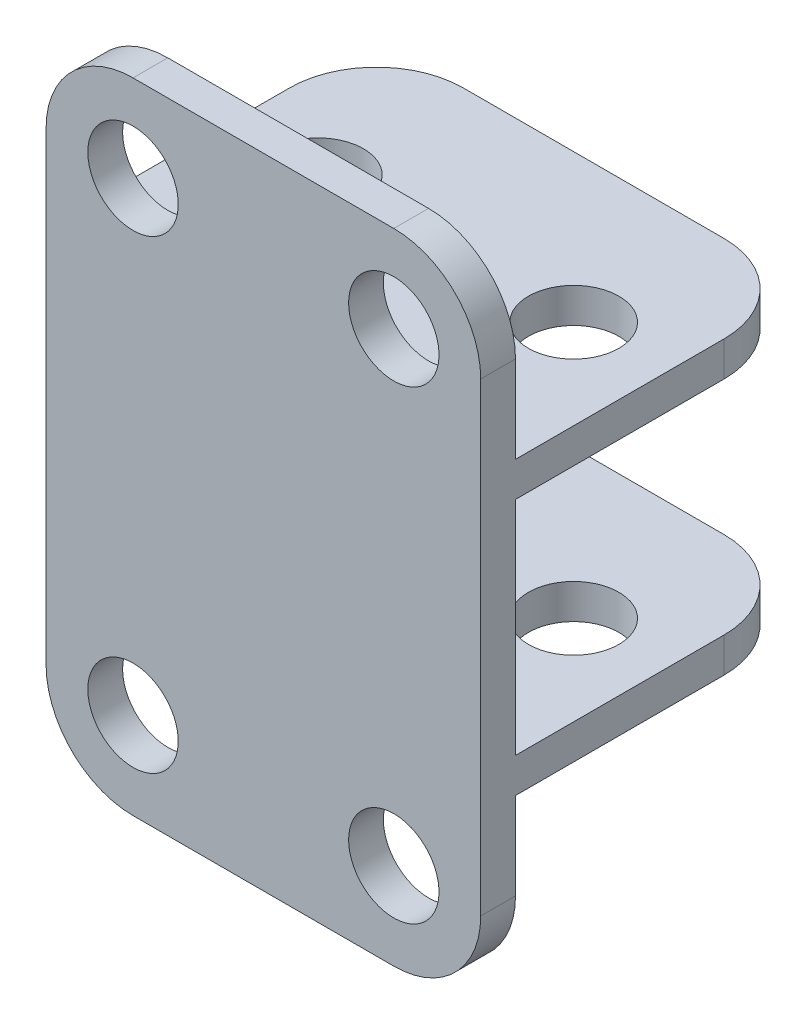
ISO-10303-21;
HEADER;
FILE_DESCRIPTION(('STEP AP214'),'2;1');
FILE_NAME('part.step','',(''),(''),'','','');
FILE_SCHEMA(('AUTOMOTIVE_DESIGN { 1 0 10303 214 1 1 1 1 }'));
ENDSEC;
DATA;
#1=APPLICATION_CONTEXT('core data for automotive mechanical design processes');
#2=APPLICATION_PROTOCOL_DEFINITION('international standard','automotive_design',2000,#1);
#3=PRODUCT_CONTEXT('',#1,'mechanical');
#4=PRODUCT('Part','Part','',(#3));
#5=PRODUCT_RELATED_PRODUCT_CATEGORY('part','',(#4));
#6=PRODUCT_DEFINITION_FORMATION('','',#4);
#7=PRODUCT_DEFINITION_CONTEXT('part definition',#1,'design');
#8=PRODUCT_DEFINITION('design','',#6,#7);
#9=PRODUCT_DEFINITION_SHAPE('','',#8);
#10=(LENGTH_UNIT() NAMED_UNIT(*) SI_UNIT(.MILLI.,.METRE.));
#11=(NAMED_UNIT(*) PLANE_ANGLE_UNIT() SI_UNIT($,.RADIAN.));
#12=(NAMED_UNIT(*) SI_UNIT($,.STERADIAN.) SOLID_ANGLE_UNIT());
#13=UNCERTAINTY_MEASURE_WITH_UNIT(LENGTH_MEASURE(1.E-05),#10,'distance_accuracy_value','');
#14=(GEOMETRIC_REPRESENTATION_CONTEXT(3) GLOBAL_UNCERTAINTY_ASSIGNED_CONTEXT((#13)) GLOBAL_UNIT_ASSIGNED_CONTEXT((#10,
#11,#12)) REPRESENTATION_CONTEXT('',''));
#15=CARTESIAN_POINT('',(0.,0.,0.));
#16=DIRECTION('',(0.,0.,1.));
#17=DIRECTION('',(1.,0.,0.));
#18=AXIS2_PLACEMENT_3D('',#15,#16,#17);
#19=CARTESIAN_POINT('',(0.,0.,0.));
#20=DIRECTION('',(0.,1.,0.));
#21=DIRECTION('',(0.,0.,1.));
#22=AXIS2_PLACEMENT_3D('',#19,#20,#21);
#23=PLANE('',#22);
#24=CARTESIAN_POINT('',(7.345,0.,0.));
#25=DIRECTION('',(0.,1.,0.));
#26=DIRECTION('',(0.,0.,1.));
#27=AXIS2_PLACEMENT_3D('',#24,#25,#26);
#28=CIRCLE('',#27,2.6);
#29=CARTESIAN_POINT('',(7.345,0.,2.6));
#30=VERTEX_POINT('',#29);
#31=EDGE_CURVE('E265',#30,#30,#28,.T.);
#32=ORIENTED_EDGE('',*,*,#31,.T.);
#33=EDGE_LOOP('',(#32));
#34=FACE_BOUND('',#33,.T.);
#35=CARTESIAN_POINT('',(-7.345,0.,0.));
#36=DIRECTION('',(0.,1.,0.));
#37=DIRECTION('',(0.,0.,1.));
#38=AXIS2_PLACEMENT_3D('',#35,#36,#37);
#39=CIRCLE('',#38,2.6);
#40=CARTESIAN_POINT('',(-7.345,0.,2.6));
#41=VERTEX_POINT('',#40);
#42=EDGE_CURVE('E273',#41,#41,#39,.T.);
#43=ORIENTED_EDGE('',*,*,#42,.T.);
#44=EDGE_LOOP('',(#43));
#45=FACE_BOUND('',#44,.T.);
#46=DIRECTION('',(0.,0.,1.));
#47=VECTOR('',#46,1.);
#48=CARTESIAN_POINT('',(-12.5,0.,8.5));
#49=LINE('',#48,#47);
#50=CARTESIAN_POINT('',(-12.5,0.,-3.5));
#51=VERTEX_POINT('',#50);
#52=CARTESIAN_POINT('',(-12.5,0.,8.5));
#53=VERTEX_POINT('',#52);
#54=EDGE_CURVE('E198',#51,#53,#49,.T.);
#55=ORIENTED_EDGE('',*,*,#54,.F.);
#56=CARTESIAN_POINT('',(-7.5,0.,-3.5));
#57=DIRECTION('',(0.,1.,0.));
#58=DIRECTION('',(0.,0.,1.));
#59=AXIS2_PLACEMENT_3D('',#56,#57,#58);
#60=CIRCLE('',#59,5.);
#61=CARTESIAN_POINT('',(-7.5,0.,-8.5));
#62=VERTEX_POINT('',#61);
#63=EDGE_CURVE('E327',#51,#62,#60,.F.);
#64=ORIENTED_EDGE('',*,*,#63,.T.);
#65=DIRECTION('',(-1.,0.,0.));
#66=VECTOR('',#65,1.);
#67=CARTESIAN_POINT('',(12.5,0.,-8.5));
#68=LINE('',#67,#66);
#69=CARTESIAN_POINT('',(7.5,0.,-8.5));
#70=VERTEX_POINT('',#69);
#71=EDGE_CURVE('E197',#70,#62,#68,.T.);
#72=ORIENTED_EDGE('',*,*,#71,.F.);
#73=CARTESIAN_POINT('',(7.5,0.,-3.5));
#74=DIRECTION('',(0.,1.,0.));
#75=DIRECTION('',(0.,0.,1.));
#76=AXIS2_PLACEMENT_3D('',#73,#74,#75);
#77=CIRCLE('',#76,5.);
#78=CARTESIAN_POINT('',(12.5,0.,-3.5));
#79=VERTEX_POINT('',#78);
#80=EDGE_CURVE('E196',#70,#79,#77,.F.);
#81=ORIENTED_EDGE('',*,*,#80,.T.);
#82=DIRECTION('',(0.,0.,-1.));
#83=VECTOR('',#82,1.);
#84=CARTESIAN_POINT('',(12.5,0.,8.5));
#85=LINE('',#84,#83);
#86=CARTESIAN_POINT('',(12.5,0.,8.5));
#87=VERTEX_POINT('',#86);
#88=EDGE_CURVE('E181',#87,#79,#85,.T.);
#89=ORIENTED_EDGE('',*,*,#88,.F.);
#90=DIRECTION('',(-1.,0.,0.));
#91=VECTOR('',#90,1.);
#92=CARTESIAN_POINT('',(-12.5,0.,8.5));
#93=LINE('',#92,#91);
#94=EDGE_CURVE('E194',#87,#53,#93,.T.);
#95=ORIENTED_EDGE('',*,*,#94,.T.);
#96=EDGE_LOOP('',(#55,#64,#72,#81,#89,#95));
#97=FACE_BOUND('',#96,.T.);
#98=ADVANCED_FACE('F39',(#34,#45,#97),#23,.F.);
#99=CARTESIAN_POINT('',(0.,16.75,0.));
#100=DIRECTION('',(0.,-1.,0.));
#101=DIRECTION('',(0.,0.,1.));
#102=AXIS2_PLACEMENT_3D('',#99,#100,#101);
#103=PLANE('',#102);
#104=CARTESIAN_POINT('',(7.345,16.75,0.));
#105=DIRECTION('',(0.,1.,0.));
#106=DIRECTION('',(0.,0.,1.));
#107=AXIS2_PLACEMENT_3D('',#104,#105,#106);
#108=CIRCLE('',#107,2.6);
#109=CARTESIAN_POINT('',(7.345,16.75,2.6));
#110=VERTEX_POINT('',#109);
#111=EDGE_CURVE('E226',#110,#110,#108,.T.);
#112=ORIENTED_EDGE('',*,*,#111,.F.);
#113=EDGE_LOOP('',(#112));
#114=FACE_BOUND('',#113,.T.);
#115=CARTESIAN_POINT('',(-7.345,16.75,0.));
#116=DIRECTION('',(0.,1.,0.));
#117=DIRECTION('',(0.,0.,1.));
#118=AXIS2_PLACEMENT_3D('',#115,#116,#117);
#119=CIRCLE('',#118,2.6);
#120=CARTESIAN_POINT('',(-7.345,16.75,2.6));
#121=VERTEX_POINT('',#120);
#122=EDGE_CURVE('E230',#121,#121,#119,.T.);
#123=ORIENTED_EDGE('',*,*,#122,.F.);
#124=EDGE_LOOP('',(#123));
#125=FACE_BOUND('',#124,.T.);
#126=DIRECTION('',(0.,0.,-1.));
#127=VECTOR('',#126,1.);
#128=CARTESIAN_POINT('',(12.5,16.75,8.5));
#129=LINE('',#128,#127);
#130=CARTESIAN_POINT('',(12.5,16.75,8.5));
#131=VERTEX_POINT('',#130);
#132=CARTESIAN_POINT('',(12.5,16.75,-3.5));
#133=VERTEX_POINT('',#132);
#134=EDGE_CURVE('E253',#131,#133,#129,.T.);
#135=ORIENTED_EDGE('',*,*,#134,.T.);
#136=CARTESIAN_POINT('',(7.5,16.75,-3.5));
#137=DIRECTION('',(0.,-1.,0.));
#138=DIRECTION('',(0.,0.,-1.));
#139=AXIS2_PLACEMENT_3D('',#136,#137,#138);
#140=CIRCLE('',#139,5.);
#141=CARTESIAN_POINT('',(7.5,16.75,-8.5));
#142=VERTEX_POINT('',#141);
#143=EDGE_CURVE('E305',#133,#142,#140,.F.);
#144=ORIENTED_EDGE('',*,*,#143,.T.);
#145=DIRECTION('',(-1.,0.,0.));
#146=VECTOR('',#145,1.);
#147=CARTESIAN_POINT('',(12.5,16.75,-8.5));
#148=LINE('',#147,#146);
#149=CARTESIAN_POINT('',(-7.5,16.75,-8.5));
#150=VERTEX_POINT('',#149);
#151=EDGE_CURVE('E242',#142,#150,#148,.T.);
#152=ORIENTED_EDGE('',*,*,#151,.T.);
#153=CARTESIAN_POINT('',(-7.5,16.75,-3.5));
#154=DIRECTION('',(0.,-1.,0.));
#155=DIRECTION('',(0.,0.,-1.));
#156=AXIS2_PLACEMENT_3D('',#153,#154,#155);
#157=CIRCLE('',#156,5.);
#158=CARTESIAN_POINT('',(-12.5,16.75,-3.5));
#159=VERTEX_POINT('',#158);
#160=EDGE_CURVE('E303',#150,#159,#157,.F.);
#161=ORIENTED_EDGE('',*,*,#160,.T.);
#162=DIRECTION('',(0.,0.,1.));
#163=VECTOR('',#162,1.);
#164=CARTESIAN_POINT('',(-12.5,16.75,8.5));
#165=LINE('',#164,#163);
#166=CARTESIAN_POINT('',(-12.5,16.75,8.5));
#167=VERTEX_POINT('',#166);
#168=EDGE_CURVE('E236',#159,#167,#165,.T.);
#169=ORIENTED_EDGE('',*,*,#168,.T.);
#170=DIRECTION('',(-1.,0.,0.));
#171=VECTOR('',#170,1.);
#172=CARTESIAN_POINT('',(-12.5,16.75,8.5));
#173=LINE('',#172,#171);
#174=EDGE_CURVE('E188',#131,#167,#173,.T.);
#175=ORIENTED_EDGE('',*,*,#174,.F.);
#176=EDGE_LOOP('',(#135,#144,#152,#161,#169,#175));
#177=FACE_BOUND('',#176,.T.);
#178=ADVANCED_FACE('F421',(#114,#125,#177),#103,.F.);
#179=CARTESIAN_POINT('',(0.,2.,0.));
#180=DIRECTION('',(0.,1.,0.));
#181=DIRECTION('',(0.,0.,1.));
#182=AXIS2_PLACEMENT_3D('',#179,#180,#181);
#183=PLANE('',#182);
#184=CARTESIAN_POINT('',(-7.345,2.,0.));
#185=DIRECTION('',(0.,1.,0.));
#186=DIRECTION('',(0.,0.,1.));
#187=AXIS2_PLACEMENT_3D('',#184,#185,#186);
#188=CIRCLE('',#187,2.6);
#189=CARTESIAN_POINT('',(-7.345,2.,2.6));
#190=VERTEX_POINT('',#189);
#191=EDGE_CURVE('E276',#190,#190,#188,.T.);
#192=ORIENTED_EDGE('',*,*,#191,.F.);
#193=EDGE_LOOP('',(#192));
#194=FACE_BOUND('',#193,.T.);
#195=DIRECTION('',(-1.,0.,0.));
#196=VECTOR('',#195,1.);
#197=CARTESIAN_POINT('',(12.5,2.,-8.5));
#198=LINE('',#197,#196);
#199=CARTESIAN_POINT('',(7.5,2.,-8.5));
#200=VERTEX_POINT('',#199);
#201=CARTESIAN_POINT('',(-7.5,2.,-8.5));
#202=VERTEX_POINT('',#201);
#203=EDGE_CURVE('E289',#200,#202,#198,.T.);
#204=ORIENTED_EDGE('',*,*,#203,.T.);
#205=CARTESIAN_POINT('',(-7.5,2.,-3.5));
#206=DIRECTION('',(0.,1.,0.));
#207=DIRECTION('',(0.,0.,1.));
#208=AXIS2_PLACEMENT_3D('',#205,#206,#207);
#209=CIRCLE('',#208,5.);
#210=CARTESIAN_POINT('',(-12.5,2.,-3.5));
#211=VERTEX_POINT('',#210);
#212=EDGE_CURVE('E336',#202,#211,#209,.T.);
#213=ORIENTED_EDGE('',*,*,#212,.T.);
#214=DIRECTION('',(0.,0.,1.));
#215=VECTOR('',#214,1.);
#216=CARTESIAN_POINT('',(-12.5,2.,8.5));
#217=LINE('',#216,#215);
#218=CARTESIAN_POINT('',(-12.5,2.,8.5));
#219=VERTEX_POINT('',#218);
#220=EDGE_CURVE('E281',#211,#219,#217,.T.);
#221=ORIENTED_EDGE('',*,*,#220,.T.);
#222=DIRECTION('',(1.,0.,0.));
#223=VECTOR('',#222,1.);
#224=CARTESIAN_POINT('',(12.5,2.,8.5));
#225=LINE('',#224,#223);
#226=CARTESIAN_POINT('',(12.5,2.,8.5));
#227=VERTEX_POINT('',#226);
#228=EDGE_CURVE('E283',#219,#227,#225,.T.);
#229=ORIENTED_EDGE('',*,*,#228,.T.);
#230=DIRECTION('',(0.,0.,-1.));
#231=VECTOR('',#230,1.);
#232=CARTESIAN_POINT('',(12.5,2.,8.5));
#233=LINE('',#232,#231);
#234=CARTESIAN_POINT('',(12.5,2.,-3.5));
#235=VERTEX_POINT('',#234);
#236=EDGE_CURVE('E286',#227,#235,#233,.T.);
#237=ORIENTED_EDGE('',*,*,#236,.T.);
#238=CARTESIAN_POINT('',(7.5,2.,-3.5));
#239=DIRECTION('',(0.,1.,0.));
#240=DIRECTION('',(0.,0.,1.));
#241=AXIS2_PLACEMENT_3D('',#238,#239,#240);
#242=CIRCLE('',#241,5.);
#243=EDGE_CURVE('E334',#235,#200,#242,.T.);
#244=ORIENTED_EDGE('',*,*,#243,.T.);
#245=EDGE_LOOP('',(#204,#213,#221,#229,#237,#244));
#246=FACE_BOUND('',#245,.T.);
#247=CARTESIAN_POINT('',(7.345,2.,0.));
#248=DIRECTION('',(0.,1.,0.));
#249=DIRECTION('',(0.,0.,1.));
#250=AXIS2_PLACEMENT_3D('',#247,#248,#249);
#251=CIRCLE('',#250,2.6);
#252=CARTESIAN_POINT('',(7.345,2.,2.6));
#253=VERTEX_POINT('',#252);
#254=EDGE_CURVE('E270',#253,#253,#251,.T.);
#255=ORIENTED_EDGE('',*,*,#254,.F.);
#256=EDGE_LOOP('',(#255));
#257=FACE_BOUND('',#256,.T.);
#258=ADVANCED_FACE('F399',(#194,#246,#257),#183,.T.);
#259=CARTESIAN_POINT('',(-12.5,2.,8.5));
#260=DIRECTION('',(1.,0.,0.));
#261=DIRECTION('',(0.,0.,-1.));
#262=AXIS2_PLACEMENT_3D('',#259,#260,#261);
#263=PLANE('',#262);
#264=ORIENTED_EDGE('',*,*,#168,.F.);
#265=DIRECTION('',(0.,1.,0.));
#266=VECTOR('',#265,1.);
#267=CARTESIAN_POINT('',(-12.5,2.,-3.5));
#268=LINE('',#267,#266);
#269=CARTESIAN_POINT('',(-12.5,14.75,-3.5));
#270=VERTEX_POINT('',#269);
#271=EDGE_CURVE('E324',#159,#270,#268,.F.);
#272=ORIENTED_EDGE('',*,*,#271,.T.);
#273=DIRECTION('',(0.,0.,1.));
#274=VECTOR('',#273,1.);
#275=CARTESIAN_POINT('',(-12.5,14.75,8.5));
#276=LINE('',#275,#274);
#277=CARTESIAN_POINT('',(-12.5,14.75,8.5));
#278=VERTEX_POINT('',#277);
#279=EDGE_CURVE('E239',#270,#278,#276,.T.);
#280=ORIENTED_EDGE('',*,*,#279,.T.);
#281=DIRECTION('',(0.,-1.,0.));
#282=VECTOR('',#281,1.);
#283=CARTESIAN_POINT('',(-12.5,0.,8.5));
#284=LINE('',#283,#282);
#285=EDGE_CURVE('E250',#278,#219,#284,.T.);
#286=ORIENTED_EDGE('',*,*,#285,.T.);
#287=ORIENTED_EDGE('',*,*,#220,.F.);
#288=DIRECTION('',(0.,-1.,0.));
#289=VECTOR('',#288,1.);
#290=CARTESIAN_POINT('',(-12.5,2.,-3.5));
#291=LINE('',#290,#289);
#292=EDGE_CURVE('E321',#211,#51,#291,.T.);
#293=ORIENTED_EDGE('',*,*,#292,.T.);
#294=ORIENTED_EDGE('',*,*,#54,.T.);
#295=DIRECTION('',(0.,1.,0.));
#296=VECTOR('',#295,1.);
#297=CARTESIAN_POINT('',(-12.5,-10.,8.5));
#298=LINE('',#297,#296);
#299=CARTESIAN_POINT('',(-12.5,-5.,8.5));
#300=VERTEX_POINT('',#299);
#301=EDGE_CURVE('E189',#300,#53,#298,.T.);
#302=ORIENTED_EDGE('',*,*,#301,.F.);
#303=DIRECTION('',(0.,0.,1.));
#304=VECTOR('',#303,1.);
#305=CARTESIAN_POINT('',(-12.5,-5.,8.5));
#306=LINE('',#305,#304);
#307=CARTESIAN_POINT('',(-12.5,-5.,10.5));
#308=VERTEX_POINT('',#307);
#309=EDGE_CURVE('E318',#300,#308,#306,.T.);
#310=ORIENTED_EDGE('',*,*,#309,.T.);
#311=DIRECTION('',(0.,-1.,0.));
#312=VECTOR('',#311,1.);
#313=CARTESIAN_POINT('',(-12.5,0.,10.5));
#314=LINE('',#313,#312);
#315=CARTESIAN_POINT('',(-12.5,21.75,10.5));
#316=VERTEX_POINT('',#315);
#317=EDGE_CURVE('E258',#316,#308,#314,.T.);
#318=ORIENTED_EDGE('',*,*,#317,.F.);
#319=DIRECTION('',(0.,0.,1.));
#320=VECTOR('',#319,1.);
#321=CARTESIAN_POINT('',(-12.5,21.75,8.5));
#322=LINE('',#321,#320);
#323=CARTESIAN_POINT('',(-12.5,21.75,8.5));
#324=VERTEX_POINT('',#323);
#325=EDGE_CURVE('E316',#316,#324,#322,.F.);
#326=ORIENTED_EDGE('',*,*,#325,.T.);
#327=DIRECTION('',(0.,-1.,0.));
#328=VECTOR('',#327,1.);
#329=CARTESIAN_POINT('',(-12.5,26.75,8.5));
#330=LINE('',#329,#328);
#331=EDGE_CURVE('E220',#324,#167,#330,.T.);
#332=ORIENTED_EDGE('',*,*,#331,.T.);
#333=EDGE_LOOP('',(#264,#272,#280,#286,#287,#293,#294,#302,#310,#318,#326,#332));
#334=FACE_BOUND('',#333,.T.);
#335=ADVANCED_FACE('F386',(#334),#263,.F.);
#336=CARTESIAN_POINT('',(12.5,2.,8.5));
#337=DIRECTION('',(-1.,0.,0.));
#338=DIRECTION('',(0.,0.,1.));
#339=AXIS2_PLACEMENT_3D('',#336,#337,#338);
#340=PLANE('',#339);
#341=DIRECTION('',(0.,0.,-1.));
#342=VECTOR('',#341,1.);
#343=CARTESIAN_POINT('',(12.5,14.75,8.5));
#344=LINE('',#343,#342);
#345=CARTESIAN_POINT('',(12.5,14.75,8.5));
#346=VERTEX_POINT('',#345);
#347=CARTESIAN_POINT('',(12.5,14.75,-3.5));
#348=VERTEX_POINT('',#347);
#349=EDGE_CURVE('E245',#346,#348,#344,.T.);
#350=ORIENTED_EDGE('',*,*,#349,.T.);
#351=DIRECTION('',(0.,1.,0.));
#352=VECTOR('',#351,1.);
#353=CARTESIAN_POINT('',(12.5,2.,-3.5));
#354=LINE('',#353,#352);
#355=EDGE_CURVE('E300',#348,#133,#354,.T.);
#356=ORIENTED_EDGE('',*,*,#355,.T.);
#357=ORIENTED_EDGE('',*,*,#134,.F.);
#358=DIRECTION('',(0.,-1.,0.));
#359=VECTOR('',#358,1.);
#360=CARTESIAN_POINT('',(12.5,26.75,8.5));
#361=LINE('',#360,#359);
#362=CARTESIAN_POINT('',(12.5,21.75,8.5));
#363=VERTEX_POINT('',#362);
#364=EDGE_CURVE('E224',#363,#131,#361,.T.);
#365=ORIENTED_EDGE('',*,*,#364,.F.);
#366=DIRECTION('',(0.,0.,-1.));
#367=VECTOR('',#366,1.);
#368=CARTESIAN_POINT('',(12.5,21.75,8.5));
#369=LINE('',#368,#367);
#370=CARTESIAN_POINT('',(12.5,21.75,10.5));
#371=VERTEX_POINT('',#370);
#372=EDGE_CURVE('E292',#363,#371,#369,.F.);
#373=ORIENTED_EDGE('',*,*,#372,.T.);
#374=DIRECTION('',(0.,1.,0.));
#375=VECTOR('',#374,1.);
#376=CARTESIAN_POINT('',(12.5,0.,10.5));
#377=LINE('',#376,#375);
#378=CARTESIAN_POINT('',(12.5,-5.,10.5));
#379=VERTEX_POINT('',#378);
#380=EDGE_CURVE('E261',#379,#371,#377,.T.);
#381=ORIENTED_EDGE('',*,*,#380,.F.);
#382=DIRECTION('',(0.,0.,-1.));
#383=VECTOR('',#382,1.);
#384=CARTESIAN_POINT('',(12.5,-5.,8.5));
#385=LINE('',#384,#383);
#386=CARTESIAN_POINT('',(12.5,-5.,8.5));
#387=VERTEX_POINT('',#386);
#388=EDGE_CURVE('E185',#379,#387,#385,.T.);
#389=ORIENTED_EDGE('',*,*,#388,.T.);
#390=DIRECTION('',(0.,1.,0.));
#391=VECTOR('',#390,1.);
#392=CARTESIAN_POINT('',(12.5,-10.,8.5));
#393=LINE('',#392,#391);
#394=EDGE_CURVE('E177',#387,#87,#393,.T.);
#395=ORIENTED_EDGE('',*,*,#394,.T.);
#396=ORIENTED_EDGE('',*,*,#88,.T.);
#397=DIRECTION('',(0.,-1.,0.));
#398=VECTOR('',#397,1.);
#399=CARTESIAN_POINT('',(12.5,2.,-3.5));
#400=LINE('',#399,#398);
#401=EDGE_CURVE('E298',#79,#235,#400,.F.);
#402=ORIENTED_EDGE('',*,*,#401,.T.);
#403=ORIENTED_EDGE('',*,*,#236,.F.);
#404=DIRECTION('',(0.,1.,0.));
#405=VECTOR('',#404,1.);
#406=CARTESIAN_POINT('',(12.5,0.,8.5));
#407=LINE('',#406,#405);
#408=EDGE_CURVE('E262',#227,#346,#407,.T.);
#409=ORIENTED_EDGE('',*,*,#408,.T.);
#410=EDGE_LOOP('',(#350,#356,#357,#365,#373,#381,#389,#395,#396,#402,#403,#409));
#411=FACE_BOUND('',#410,.T.);
#412=ADVANCED_FACE('F180',(#411),#340,.F.);
#413=CARTESIAN_POINT('',(12.5,2.,-8.5));
#414=DIRECTION('',(0.,0.,1.));
#415=DIRECTION('',(1.,0.,0.));
#416=AXIS2_PLACEMENT_3D('',#413,#414,#415);
#417=PLANE('',#416);
#418=ORIENTED_EDGE('',*,*,#71,.T.);
#419=DIRECTION('',(0.,-1.,0.));
#420=VECTOR('',#419,1.);
#421=CARTESIAN_POINT('',(-7.5,2.,-8.5));
#422=LINE('',#421,#420);
#423=EDGE_CURVE('E332',#62,#202,#422,.F.);
#424=ORIENTED_EDGE('',*,*,#423,.T.);
#425=ORIENTED_EDGE('',*,*,#203,.F.);
#426=DIRECTION('',(0.,-1.,0.));
#427=VECTOR('',#426,1.);
#428=CARTESIAN_POINT('',(7.5,2.,-8.5));
#429=LINE('',#428,#427);
#430=EDGE_CURVE('E329',#200,#70,#429,.T.);
#431=ORIENTED_EDGE('',*,*,#430,.T.);
#432=EDGE_LOOP('',(#418,#424,#425,#431));
#433=FACE_BOUND('',#432,.T.);
#434=ADVANCED_FACE('F393',(#433),#417,.F.);
#435=CARTESIAN_POINT('',(-7.345,2.,0.));
#436=DIRECTION('',(0.,-1.,0.));
#437=DIRECTION('',(0.,0.,-1.));
#438=AXIS2_PLACEMENT_3D('',#435,#436,#437);
#439=CYLINDRICAL_SURFACE('',#438,2.6);
#440=ORIENTED_EDGE('',*,*,#191,.T.);
#441=EDGE_LOOP('',(#440));
#442=FACE_BOUND('',#441,.T.);
#443=ORIENTED_EDGE('',*,*,#42,.F.);
#444=EDGE_LOOP('',(#443));
#445=FACE_BOUND('',#444,.T.);
#446=ADVANCED_FACE('F435',(#442,#445),#439,.F.);
#447=CARTESIAN_POINT('',(7.345,2.,0.));
#448=DIRECTION('',(0.,-1.,0.));
#449=DIRECTION('',(0.,0.,-1.));
#450=AXIS2_PLACEMENT_3D('',#447,#448,#449);
#451=CYLINDRICAL_SURFACE('',#450,2.6);
#452=ORIENTED_EDGE('',*,*,#254,.T.);
#453=EDGE_LOOP('',(#452));
#454=FACE_BOUND('',#453,.T.);
#455=ORIENTED_EDGE('',*,*,#31,.F.);
#456=EDGE_LOOP('',(#455));
#457=FACE_BOUND('',#456,.T.);
#458=ADVANCED_FACE('F610',(#454,#457),#451,.F.);
#459=CARTESIAN_POINT('',(0.,0.,8.5));
#460=DIRECTION('',(0.,0.,-1.));
#461=DIRECTION('',(-1.,0.,0.));
#462=AXIS2_PLACEMENT_3D('',#459,#460,#461);
#463=PLANE('',#462);
#464=ORIENTED_EDGE('',*,*,#228,.F.);
#465=ORIENTED_EDGE('',*,*,#285,.F.);
#466=DIRECTION('',(1.,0.,0.));
#467=VECTOR('',#466,1.);
#468=CARTESIAN_POINT('',(12.5,14.75,8.5));
#469=LINE('',#468,#467);
#470=EDGE_CURVE('E241',#278,#346,#469,.T.);
#471=ORIENTED_EDGE('',*,*,#470,.T.);
#472=ORIENTED_EDGE('',*,*,#408,.F.);
#473=EDGE_LOOP('',(#464,#465,#471,#472));
#474=FACE_BOUND('',#473,.T.);
#475=ADVANCED_FACE('F406',(#474),#463,.T.);
#476=CARTESIAN_POINT('',(0.,0.,10.5));
#477=DIRECTION('',(0.,0.,-1.));
#478=DIRECTION('',(-1.,0.,0.));
#479=AXIS2_PLACEMENT_3D('',#476,#477,#478);
#480=PLANE('',#479);
#481=CARTESIAN_POINT('',(7.50000000000001,-5.,10.5));
#482=DIRECTION('',(0.,0.,-1.));
#483=DIRECTION('',(-1.,0.,0.));
#484=AXIS2_PLACEMENT_3D('',#481,#482,#483);
#485=CIRCLE('',#484,2.6);
#486=CARTESIAN_POINT('',(4.9,-5.,10.5));
#487=VERTEX_POINT('',#486);
#488=EDGE_CURVE('E691',#487,#487,#485,.T.);
#489=ORIENTED_EDGE('',*,*,#488,.T.);
#490=EDGE_LOOP('',(#489));
#491=FACE_BOUND('',#490,.T.);
#492=CARTESIAN_POINT('',(-7.5,-5.00000000000002,10.5));
#493=DIRECTION('',(0.,0.,-1.));
#494=DIRECTION('',(-1.,0.,0.));
#495=AXIS2_PLACEMENT_3D('',#492,#493,#494);
#496=CIRCLE('',#495,2.6);
#497=CARTESIAN_POINT('',(-10.1,-5.00000000000002,10.5));
#498=VERTEX_POINT('',#497);
#499=EDGE_CURVE('E694',#498,#498,#496,.T.);
#500=ORIENTED_EDGE('',*,*,#499,.T.);
#501=EDGE_LOOP('',(#500));
#502=FACE_BOUND('',#501,.T.);
#503=CARTESIAN_POINT('',(-7.5,21.75,10.5));
#504=DIRECTION('',(0.,0.,-1.));
#505=DIRECTION('',(-1.,0.,0.));
#506=AXIS2_PLACEMENT_3D('',#503,#504,#505);
#507=CIRCLE('',#506,2.6);
#508=CARTESIAN_POINT('',(-10.1,21.75,10.5));
#509=VERTEX_POINT('',#508);
#510=EDGE_CURVE('E204',#509,#509,#507,.T.);
#511=ORIENTED_EDGE('',*,*,#510,.T.);
#512=EDGE_LOOP('',(#511));
#513=FACE_BOUND('',#512,.T.);
#514=CARTESIAN_POINT('',(7.50000000000001,21.75,10.5));
#515=DIRECTION('',(0.,0.,-1.));
#516=DIRECTION('',(-1.,0.,0.));
#517=AXIS2_PLACEMENT_3D('',#514,#515,#516);
#518=CIRCLE('',#517,2.6);
#519=CARTESIAN_POINT('',(4.9,21.75,10.5));
#520=VERTEX_POINT('',#519);
#521=EDGE_CURVE('E210',#520,#520,#518,.T.);
#522=ORIENTED_EDGE('',*,*,#521,.T.);
#523=EDGE_LOOP('',(#522));
#524=FACE_BOUND('',#523,.T.);
#525=DIRECTION('',(1.,0.,0.));
#526=VECTOR('',#525,1.);
#527=CARTESIAN_POINT('',(-12.5,-10.,10.5));
#528=LINE('',#527,#526);
#529=CARTESIAN_POINT('',(-7.5,-10.,10.5));
#530=VERTEX_POINT('',#529);
#531=CARTESIAN_POINT('',(7.5,-10.,10.5));
#532=VERTEX_POINT('',#531);
#533=EDGE_CURVE('E203',#530,#532,#528,.T.);
#534=ORIENTED_EDGE('',*,*,#533,.T.);
#535=CARTESIAN_POINT('',(7.5,-5.,10.5));
#536=DIRECTION('',(0.,0.,-1.));
#537=DIRECTION('',(-1.,0.,0.));
#538=AXIS2_PLACEMENT_3D('',#535,#536,#537);
#539=CIRCLE('',#538,5.);
#540=EDGE_CURVE('E352',#532,#379,#539,.F.);
#541=ORIENTED_EDGE('',*,*,#540,.T.);
#542=ORIENTED_EDGE('',*,*,#380,.T.);
#543=CARTESIAN_POINT('',(7.5,21.75,10.5));
#544=DIRECTION('',(0.,0.,-1.));
#545=DIRECTION('',(-1.,0.,0.));
#546=AXIS2_PLACEMENT_3D('',#543,#544,#545);
#547=CIRCLE('',#546,5.);
#548=CARTESIAN_POINT('',(7.5,26.75,10.5));
#549=VERTEX_POINT('',#548);
#550=EDGE_CURVE('E348',#371,#549,#547,.F.);
#551=ORIENTED_EDGE('',*,*,#550,.T.);
#552=DIRECTION('',(1.,0.,0.));
#553=VECTOR('',#552,1.);
#554=CARTESIAN_POINT('',(-12.5,26.75,10.5));
#555=LINE('',#554,#553);
#556=CARTESIAN_POINT('',(-7.5,26.75,10.5));
#557=VERTEX_POINT('',#556);
#558=EDGE_CURVE('E215',#557,#549,#555,.T.);
#559=ORIENTED_EDGE('',*,*,#558,.F.);
#560=CARTESIAN_POINT('',(-7.5,21.75,10.5));
#561=DIRECTION('',(0.,0.,-1.));
#562=DIRECTION('',(-1.,0.,0.));
#563=AXIS2_PLACEMENT_3D('',#560,#561,#562);
#564=CIRCLE('',#563,5.);
#565=EDGE_CURVE('E346',#557,#316,#564,.F.);
#566=ORIENTED_EDGE('',*,*,#565,.T.);
#567=ORIENTED_EDGE('',*,*,#317,.T.);
#568=CARTESIAN_POINT('',(-7.5,-5.,10.5));
#569=DIRECTION('',(0.,0.,-1.));
#570=DIRECTION('',(-1.,0.,0.));
#571=AXIS2_PLACEMENT_3D('',#568,#569,#570);
#572=CIRCLE('',#571,5.);
#573=EDGE_CURVE('E350',#308,#530,#572,.F.);
#574=ORIENTED_EDGE('',*,*,#573,.T.);
#575=EDGE_LOOP('',(#534,#541,#542,#551,#559,#566,#567,#574));
#576=FACE_BOUND('',#575,.T.);
#577=ADVANCED_FACE('F369',(#491,#502,#513,#524,#576),#480,.F.);
#578=CARTESIAN_POINT('',(0.,14.75,0.));
#579=DIRECTION('',(0.,-1.,0.));
#580=DIRECTION('',(0.,0.,1.));
#581=AXIS2_PLACEMENT_3D('',#578,#579,#580);
#582=PLANE('',#581);
#583=CARTESIAN_POINT('',(-7.345,14.75,0.));
#584=DIRECTION('',(0.,1.,0.));
#585=DIRECTION('',(0.,0.,1.));
#586=AXIS2_PLACEMENT_3D('',#583,#584,#585);
#587=CIRCLE('',#586,2.6);
#588=CARTESIAN_POINT('',(-7.345,14.75,2.6));
#589=VERTEX_POINT('',#588);
#590=EDGE_CURVE('E233',#589,#589,#587,.T.);
#591=ORIENTED_EDGE('',*,*,#590,.T.);
#592=EDGE_LOOP('',(#591));
#593=FACE_BOUND('',#592,.T.);
#594=DIRECTION('',(-1.,0.,0.));
#595=VECTOR('',#594,1.);
#596=CARTESIAN_POINT('',(12.5,14.75,-8.5));
#597=LINE('',#596,#595);
#598=CARTESIAN_POINT('',(7.5,14.75,-8.5));
#599=VERTEX_POINT('',#598);
#600=CARTESIAN_POINT('',(-7.5,14.75,-8.5));
#601=VERTEX_POINT('',#600);
#602=EDGE_CURVE('E247',#599,#601,#597,.T.);
#603=ORIENTED_EDGE('',*,*,#602,.F.);
#604=CARTESIAN_POINT('',(7.5,14.75,-3.5));
#605=DIRECTION('',(0.,-1.,0.));
#606=DIRECTION('',(0.,0.,-1.));
#607=AXIS2_PLACEMENT_3D('',#604,#605,#606);
#608=CIRCLE('',#607,5.);
#609=EDGE_CURVE('E314',#599,#348,#608,.T.);
#610=ORIENTED_EDGE('',*,*,#609,.T.);
#611=ORIENTED_EDGE('',*,*,#349,.F.);
#612=ORIENTED_EDGE('',*,*,#470,.F.);
#613=ORIENTED_EDGE('',*,*,#279,.F.);
#614=CARTESIAN_POINT('',(-7.5,14.75,-3.5));
#615=DIRECTION('',(0.,-1.,0.));
#616=DIRECTION('',(0.,0.,-1.));
#617=AXIS2_PLACEMENT_3D('',#614,#615,#616);
#618=CIRCLE('',#617,5.);
#619=EDGE_CURVE('E312',#270,#601,#618,.T.);
#620=ORIENTED_EDGE('',*,*,#619,.T.);
#621=EDGE_LOOP('',(#603,#610,#611,#612,#613,#620));
#622=FACE_BOUND('',#621,.T.);
#623=CARTESIAN_POINT('',(7.345,14.75,0.));
#624=DIRECTION('',(0.,1.,0.));
#625=DIRECTION('',(0.,0.,1.));
#626=AXIS2_PLACEMENT_3D('',#623,#624,#625);
#627=CIRCLE('',#626,2.6);
#628=CARTESIAN_POINT('',(7.345,14.75,2.6));
#629=VERTEX_POINT('',#628);
#630=EDGE_CURVE('E227',#629,#629,#627,.T.);
#631=ORIENTED_EDGE('',*,*,#630,.T.);
#632=EDGE_LOOP('',(#631));
#633=FACE_BOUND('',#632,.T.);
#634=ADVANCED_FACE('F453',(#593,#622,#633),#582,.T.);
#635=CARTESIAN_POINT('',(12.5,14.75,-8.5));
#636=DIRECTION('',(0.,0.,1.));
#637=DIRECTION('',(1.,0.,0.));
#638=AXIS2_PLACEMENT_3D('',#635,#636,#637);
#639=PLANE('',#638);
#640=ORIENTED_EDGE('',*,*,#151,.F.);
#641=DIRECTION('',(0.,1.,0.));
#642=VECTOR('',#641,1.);
#643=CARTESIAN_POINT('',(7.5,14.75,-8.5));
#644=LINE('',#643,#642);
#645=EDGE_CURVE('E310',#142,#599,#644,.F.);
#646=ORIENTED_EDGE('',*,*,#645,.T.);
#647=ORIENTED_EDGE('',*,*,#602,.T.);
#648=DIRECTION('',(0.,1.,0.));
#649=VECTOR('',#648,1.);
#650=CARTESIAN_POINT('',(-7.5,14.75,-8.5));
#651=LINE('',#650,#649);
#652=EDGE_CURVE('E307',#601,#150,#651,.T.);
#653=ORIENTED_EDGE('',*,*,#652,.T.);
#654=EDGE_LOOP('',(#640,#646,#647,#653));
#655=FACE_BOUND('',#654,.T.);
#656=ADVANCED_FACE('F458',(#655),#639,.F.);
#657=CARTESIAN_POINT('',(-7.345,14.75,0.));
#658=DIRECTION('',(0.,1.,0.));
#659=DIRECTION('',(0.,0.,-1.));
#660=AXIS2_PLACEMENT_3D('',#657,#658,#659);
#661=CYLINDRICAL_SURFACE('',#660,2.6);
#662=ORIENTED_EDGE('',*,*,#590,.F.);
#663=EDGE_LOOP('',(#662));
#664=FACE_BOUND('',#663,.T.);
#665=ORIENTED_EDGE('',*,*,#122,.T.);
#666=EDGE_LOOP('',(#665));
#667=FACE_BOUND('',#666,.T.);
#668=ADVANCED_FACE('F533',(#664,#667),#661,.F.);
#669=CARTESIAN_POINT('',(7.345,14.75,0.));
#670=DIRECTION('',(0.,1.,0.));
#671=DIRECTION('',(0.,0.,-1.));
#672=AXIS2_PLACEMENT_3D('',#669,#670,#671);
#673=CYLINDRICAL_SURFACE('',#672,2.6);
#674=ORIENTED_EDGE('',*,*,#630,.F.);
#675=EDGE_LOOP('',(#674));
#676=FACE_BOUND('',#675,.T.);
#677=ORIENTED_EDGE('',*,*,#111,.T.);
#678=EDGE_LOOP('',(#677));
#679=FACE_BOUND('',#678,.T.);
#680=ADVANCED_FACE('F598',(#676,#679),#673,.F.);
#681=CARTESIAN_POINT('',(-12.5,26.75,8.5));
#682=DIRECTION('',(0.,0.,1.));
#683=DIRECTION('',(1.,0.,0.));
#684=AXIS2_PLACEMENT_3D('',#681,#682,#683);
#685=PLANE('',#684);
#686=CARTESIAN_POINT('',(-7.5,21.75,8.5));
#687=DIRECTION('',(0.,0.,-1.));
#688=DIRECTION('',(1.,0.,0.));
#689=AXIS2_PLACEMENT_3D('',#686,#687,#688);
#690=CIRCLE('',#689,2.6);
#691=CARTESIAN_POINT('',(-4.9,21.75,8.5));
#692=VERTEX_POINT('',#691);
#693=EDGE_CURVE('E684',#692,#692,#690,.T.);
#694=ORIENTED_EDGE('',*,*,#693,.F.);
#695=EDGE_LOOP('',(#694));
#696=FACE_BOUND('',#695,.T.);
#697=CARTESIAN_POINT('',(7.50000000000001,21.75,8.5));
#698=DIRECTION('',(0.,0.,-1.));
#699=DIRECTION('',(-1.,0.,0.));
#700=AXIS2_PLACEMENT_3D('',#697,#698,#699);
#701=CIRCLE('',#700,2.6);
#702=CARTESIAN_POINT('',(4.9,21.75,8.5));
#703=VERTEX_POINT('',#702);
#704=EDGE_CURVE('E699',#703,#703,#701,.T.);
#705=ORIENTED_EDGE('',*,*,#704,.F.);
#706=EDGE_LOOP('',(#705));
#707=FACE_BOUND('',#706,.T.);
#708=DIRECTION('',(-1.,0.,0.));
#709=VECTOR('',#708,1.);
#710=CARTESIAN_POINT('',(-12.5,26.75,8.5));
#711=LINE('',#710,#709);
#712=CARTESIAN_POINT('',(7.5,26.75,8.5));
#713=VERTEX_POINT('',#712);
#714=CARTESIAN_POINT('',(-7.5,26.75,8.5));
#715=VERTEX_POINT('',#714);
#716=EDGE_CURVE('E218',#713,#715,#711,.T.);
#717=ORIENTED_EDGE('',*,*,#716,.F.);
#718=CARTESIAN_POINT('',(7.5,21.75,8.5));
#719=DIRECTION('',(0.,0.,1.));
#720=DIRECTION('',(1.,0.,0.));
#721=AXIS2_PLACEMENT_3D('',#718,#719,#720);
#722=CIRCLE('',#721,5.);
#723=EDGE_CURVE('E11',#713,#363,#722,.F.);
#724=ORIENTED_EDGE('',*,*,#723,.T.);
#725=ORIENTED_EDGE('',*,*,#364,.T.);
#726=ORIENTED_EDGE('',*,*,#174,.T.);
#727=ORIENTED_EDGE('',*,*,#331,.F.);
#728=CARTESIAN_POINT('',(-7.5,21.75,8.5));
#729=DIRECTION('',(0.,0.,1.));
#730=DIRECTION('',(1.,0.,0.));
#731=AXIS2_PLACEMENT_3D('',#728,#729,#730);
#732=CIRCLE('',#731,5.);
#733=EDGE_CURVE('E47',#324,#715,#732,.F.);
#734=ORIENTED_EDGE('',*,*,#733,.T.);
#735=EDGE_LOOP('',(#717,#724,#725,#726,#727,#734));
#736=FACE_BOUND('',#735,.T.);
#737=ADVANCED_FACE('F363',(#696,#707,#736),#685,.F.);
#738=CARTESIAN_POINT('',(0.,26.75,0.));
#739=DIRECTION('',(0.,-1.,0.));
#740=DIRECTION('',(0.,0.,-1.));
#741=AXIS2_PLACEMENT_3D('',#738,#739,#740);
#742=PLANE('',#741);
#743=ORIENTED_EDGE('',*,*,#558,.T.);
#744=DIRECTION('',(0.,0.,-1.));
#745=VECTOR('',#744,1.);
#746=CARTESIAN_POINT('',(7.5,26.75,0.));
#747=LINE('',#746,#745);
#748=EDGE_CURVE('E357',#549,#713,#747,.T.);
#749=ORIENTED_EDGE('',*,*,#748,.T.);
#750=ORIENTED_EDGE('',*,*,#716,.T.);
#751=DIRECTION('',(0.,0.,1.));
#752=VECTOR('',#751,1.);
#753=CARTESIAN_POINT('',(-7.5,26.75,0.));
#754=LINE('',#753,#752);
#755=EDGE_CURVE('E354',#715,#557,#754,.T.);
#756=ORIENTED_EDGE('',*,*,#755,.T.);
#757=EDGE_LOOP('',(#743,#749,#750,#756));
#758=FACE_BOUND('',#757,.T.);
#759=ADVANCED_FACE('F359',(#758),#742,.F.);
#760=CARTESIAN_POINT('',(-12.5,-10.,8.5));
#761=DIRECTION('',(0.,0.,1.));
#762=DIRECTION('',(1.,0.,0.));
#763=AXIS2_PLACEMENT_3D('',#760,#761,#762);
#764=PLANE('',#763);
#765=CARTESIAN_POINT('',(7.50000000000001,-5.,8.5));
#766=DIRECTION('',(0.,0.,-1.));
#767=DIRECTION('',(1.,0.,0.));
#768=AXIS2_PLACEMENT_3D('',#765,#766,#767);
#769=CIRCLE('',#768,2.6);
#770=CARTESIAN_POINT('',(10.1,-5.,8.5));
#771=VERTEX_POINT('',#770);
#772=EDGE_CURVE('E702',#771,#771,#769,.T.);
#773=ORIENTED_EDGE('',*,*,#772,.F.);
#774=EDGE_LOOP('',(#773));
#775=FACE_BOUND('',#774,.T.);
#776=CARTESIAN_POINT('',(-7.5,-5.00000000000002,8.5));
#777=DIRECTION('',(0.,0.,-1.));
#778=DIRECTION('',(-1.,0.,0.));
#779=AXIS2_PLACEMENT_3D('',#776,#777,#778);
#780=CIRCLE('',#779,2.6);
#781=CARTESIAN_POINT('',(-10.1,-5.00000000000002,8.5));
#782=VERTEX_POINT('',#781);
#783=EDGE_CURVE('E705',#782,#782,#780,.T.);
#784=ORIENTED_EDGE('',*,*,#783,.F.);
#785=EDGE_LOOP('',(#784));
#786=FACE_BOUND('',#785,.T.);
#787=ORIENTED_EDGE('',*,*,#394,.F.);
#788=CARTESIAN_POINT('',(7.5,-5.,8.5));
#789=DIRECTION('',(0.,0.,1.));
#790=DIRECTION('',(1.,0.,0.));
#791=AXIS2_PLACEMENT_3D('',#788,#789,#790);
#792=CIRCLE('',#791,5.);
#793=CARTESIAN_POINT('',(7.5,-10.,8.5));
#794=VERTEX_POINT('',#793);
#795=EDGE_CURVE('E340',#387,#794,#792,.F.);
#796=ORIENTED_EDGE('',*,*,#795,.T.);
#797=DIRECTION('',(-1.,0.,0.));
#798=VECTOR('',#797,1.);
#799=CARTESIAN_POINT('',(-12.5,-10.,8.5));
#800=LINE('',#799,#798);
#801=CARTESIAN_POINT('',(-7.5,-10.,8.5));
#802=VERTEX_POINT('',#801);
#803=EDGE_CURVE('E207',#794,#802,#800,.T.);
#804=ORIENTED_EDGE('',*,*,#803,.T.);
#805=CARTESIAN_POINT('',(-7.5,-5.,8.5));
#806=DIRECTION('',(0.,0.,1.));
#807=DIRECTION('',(1.,0.,0.));
#808=AXIS2_PLACEMENT_3D('',#805,#806,#807);
#809=CIRCLE('',#808,5.);
#810=EDGE_CURVE('E338',#802,#300,#809,.F.);
#811=ORIENTED_EDGE('',*,*,#810,.T.);
#812=ORIENTED_EDGE('',*,*,#301,.T.);
#813=ORIENTED_EDGE('',*,*,#94,.F.);
#814=EDGE_LOOP('',(#787,#796,#804,#811,#812,#813));
#815=FACE_BOUND('',#814,.T.);
#816=ADVANCED_FACE('F200',(#775,#786,#815),#764,.F.);
#817=CARTESIAN_POINT('',(0.,-10.,0.));
#818=DIRECTION('',(0.,1.,0.));
#819=DIRECTION('',(0.,0.,-1.));
#820=AXIS2_PLACEMENT_3D('',#817,#818,#819);
#821=PLANE('',#820);
#822=ORIENTED_EDGE('',*,*,#803,.F.);
#823=DIRECTION('',(0.,0.,-1.));
#824=VECTOR('',#823,1.);
#825=CARTESIAN_POINT('',(7.5,-10.,0.));
#826=LINE('',#825,#824);
#827=EDGE_CURVE('E344',#794,#532,#826,.F.);
#828=ORIENTED_EDGE('',*,*,#827,.T.);
#829=ORIENTED_EDGE('',*,*,#533,.F.);
#830=DIRECTION('',(0.,0.,1.));
#831=VECTOR('',#830,1.);
#832=CARTESIAN_POINT('',(-7.5,-10.,0.));
#833=LINE('',#832,#831);
#834=EDGE_CURVE('E342',#530,#802,#833,.F.);
#835=ORIENTED_EDGE('',*,*,#834,.T.);
#836=EDGE_LOOP('',(#822,#828,#829,#835));
#837=FACE_BOUND('',#836,.T.);
#838=ADVANCED_FACE('F378',(#837),#821,.F.);
#839=CARTESIAN_POINT('',(7.5,2.,-3.5));
#840=DIRECTION('',(0.,1.,0.));
#841=DIRECTION('',(0.,0.,1.));
#842=AXIS2_PLACEMENT_3D('',#839,#840,#841);
#843=CYLINDRICAL_SURFACE('',#842,5.);
#844=ORIENTED_EDGE('',*,*,#609,.F.);
#845=ORIENTED_EDGE('',*,*,#645,.F.);
#846=ORIENTED_EDGE('',*,*,#143,.F.);
#847=ORIENTED_EDGE('',*,*,#355,.F.);
#848=EDGE_LOOP('',(#844,#845,#846,#847));
#849=FACE_BOUND('',#848,.T.);
#850=ADVANCED_FACE('F440',(#849),#843,.T.);
#851=CARTESIAN_POINT('',(-7.5,14.75,-3.5));
#852=DIRECTION('',(0.,1.,0.));
#853=DIRECTION('',(0.,0.,1.));
#854=AXIS2_PLACEMENT_3D('',#851,#852,#853);
#855=CYLINDRICAL_SURFACE('',#854,5.);
#856=ORIENTED_EDGE('',*,*,#619,.F.);
#857=ORIENTED_EDGE('',*,*,#271,.F.);
#858=ORIENTED_EDGE('',*,*,#160,.F.);
#859=ORIENTED_EDGE('',*,*,#652,.F.);
#860=EDGE_LOOP('',(#856,#857,#858,#859));
#861=FACE_BOUND('',#860,.T.);
#862=ADVANCED_FACE('F418',(#861),#855,.T.);
#863=CARTESIAN_POINT('',(-7.5,2.,-3.5));
#864=DIRECTION('',(0.,-1.,0.));
#865=DIRECTION('',(0.,0.,-1.));
#866=AXIS2_PLACEMENT_3D('',#863,#864,#865);
#867=CYLINDRICAL_SURFACE('',#866,5.);
#868=ORIENTED_EDGE('',*,*,#212,.F.);
#869=ORIENTED_EDGE('',*,*,#423,.F.);
#870=ORIENTED_EDGE('',*,*,#63,.F.);
#871=ORIENTED_EDGE('',*,*,#292,.F.);
#872=EDGE_LOOP('',(#868,#869,#870,#871));
#873=FACE_BOUND('',#872,.T.);
#874=ADVANCED_FACE('F397',(#873),#867,.T.);
#875=CARTESIAN_POINT('',(7.5,2.,-3.5));
#876=DIRECTION('',(0.,-1.,0.));
#877=DIRECTION('',(0.,0.,-1.));
#878=AXIS2_PLACEMENT_3D('',#875,#876,#877);
#879=CYLINDRICAL_SURFACE('',#878,5.);
#880=ORIENTED_EDGE('',*,*,#243,.F.);
#881=ORIENTED_EDGE('',*,*,#401,.F.);
#882=ORIENTED_EDGE('',*,*,#80,.F.);
#883=ORIENTED_EDGE('',*,*,#430,.F.);
#884=EDGE_LOOP('',(#880,#881,#882,#883));
#885=FACE_BOUND('',#884,.T.);
#886=ADVANCED_FACE('F410',(#885),#879,.T.);
#887=CARTESIAN_POINT('',(7.5,-5.,8.5));
#888=DIRECTION('',(0.,0.,-1.));
#889=DIRECTION('',(-1.,0.,0.));
#890=AXIS2_PLACEMENT_3D('',#887,#888,#889);
#891=CYLINDRICAL_SURFACE('',#890,5.);
#892=ORIENTED_EDGE('',*,*,#540,.F.);
#893=ORIENTED_EDGE('',*,*,#827,.F.);
#894=ORIENTED_EDGE('',*,*,#795,.F.);
#895=ORIENTED_EDGE('',*,*,#388,.F.);
#896=EDGE_LOOP('',(#892,#893,#894,#895));
#897=FACE_BOUND('',#896,.T.);
#898=ADVANCED_FACE('F372',(#897),#891,.T.);
#899=CARTESIAN_POINT('',(-7.5,-5.,8.5));
#900=DIRECTION('',(0.,0.,1.));
#901=DIRECTION('',(1.,0.,0.));
#902=AXIS2_PLACEMENT_3D('',#899,#900,#901);
#903=CYLINDRICAL_SURFACE('',#902,5.);
#904=ORIENTED_EDGE('',*,*,#810,.F.);
#905=ORIENTED_EDGE('',*,*,#834,.F.);
#906=ORIENTED_EDGE('',*,*,#573,.F.);
#907=ORIENTED_EDGE('',*,*,#309,.F.);
#908=EDGE_LOOP('',(#904,#905,#906,#907));
#909=FACE_BOUND('',#908,.T.);
#910=ADVANCED_FACE('F382',(#909),#903,.T.);
#911=CARTESIAN_POINT('',(7.5,21.75,0.));
#912=DIRECTION('',(0.,0.,-1.));
#913=DIRECTION('',(-1.,0.,0.));
#914=AXIS2_PLACEMENT_3D('',#911,#912,#913);
#915=CYLINDRICAL_SURFACE('',#914,5.);
#916=ORIENTED_EDGE('',*,*,#550,.F.);
#917=ORIENTED_EDGE('',*,*,#372,.F.);
#918=ORIENTED_EDGE('',*,*,#723,.F.);
#919=ORIENTED_EDGE('',*,*,#748,.F.);
#920=EDGE_LOOP('',(#916,#917,#918,#919));
#921=FACE_BOUND('',#920,.T.);
#922=ADVANCED_FACE('F367',(#921),#915,.T.);
#923=CARTESIAN_POINT('',(-7.5,21.75,0.));
#924=DIRECTION('',(0.,0.,1.));
#925=DIRECTION('',(1.,0.,0.));
#926=AXIS2_PLACEMENT_3D('',#923,#924,#925);
#927=CYLINDRICAL_SURFACE('',#926,5.);
#928=ORIENTED_EDGE('',*,*,#733,.F.);
#929=ORIENTED_EDGE('',*,*,#325,.F.);
#930=ORIENTED_EDGE('',*,*,#565,.F.);
#931=ORIENTED_EDGE('',*,*,#755,.F.);
#932=EDGE_LOOP('',(#928,#929,#930,#931));
#933=FACE_BOUND('',#932,.T.);
#934=ADVANCED_FACE('F41',(#933),#927,.T.);
#935=CARTESIAN_POINT('',(-7.5,-5.00000000000002,18.5));
#936=DIRECTION('',(0.,0.,-1.));
#937=DIRECTION('',(-1.,0.,0.));
#938=AXIS2_PLACEMENT_3D('',#935,#936,#937);
#939=CYLINDRICAL_SURFACE('',#938,2.6);
#940=ORIENTED_EDGE('',*,*,#783,.T.);
#941=EDGE_LOOP('',(#940));
#942=FACE_BOUND('',#941,.T.);
#943=ORIENTED_EDGE('',*,*,#499,.F.);
#944=EDGE_LOOP('',(#943));
#945=FACE_BOUND('',#944,.T.);
#946=ADVANCED_FACE('F465',(#942,#945),#939,.F.);
#947=CARTESIAN_POINT('',(7.50000000000001,-5.,18.5));
#948=DIRECTION('',(0.,0.,-1.));
#949=DIRECTION('',(-1.,0.,0.));
#950=AXIS2_PLACEMENT_3D('',#947,#948,#949);
#951=CYLINDRICAL_SURFACE('',#950,2.6);
#952=ORIENTED_EDGE('',*,*,#772,.T.);
#953=EDGE_LOOP('',(#952));
#954=FACE_BOUND('',#953,.T.);
#955=ORIENTED_EDGE('',*,*,#488,.F.);
#956=EDGE_LOOP('',(#955));
#957=FACE_BOUND('',#956,.T.);
#958=ADVANCED_FACE('F470',(#954,#957),#951,.F.);
#959=CARTESIAN_POINT('',(7.50000000000001,21.75,18.5));
#960=DIRECTION('',(0.,0.,-1.));
#961=DIRECTION('',(-1.,0.,0.));
#962=AXIS2_PLACEMENT_3D('',#959,#960,#961);
#963=CYLINDRICAL_SURFACE('',#962,2.6);
#964=ORIENTED_EDGE('',*,*,#704,.T.);
#965=EDGE_LOOP('',(#964));
#966=FACE_BOUND('',#965,.T.);
#967=ORIENTED_EDGE('',*,*,#521,.F.);
#968=EDGE_LOOP('',(#967));
#969=FACE_BOUND('',#968,.T.);
#970=ADVANCED_FACE('F669',(#966,#969),#963,.F.);
#971=CARTESIAN_POINT('',(-7.5,21.75,18.5));
#972=DIRECTION('',(0.,0.,-1.));
#973=DIRECTION('',(-1.,0.,0.));
#974=AXIS2_PLACEMENT_3D('',#971,#972,#973);
#975=CYLINDRICAL_SURFACE('',#974,2.6);
#976=ORIENTED_EDGE('',*,*,#693,.T.);
#977=EDGE_LOOP('',(#976));
#978=FACE_BOUND('',#977,.T.);
#979=ORIENTED_EDGE('',*,*,#510,.F.);
#980=EDGE_LOOP('',(#979));
#981=FACE_BOUND('',#980,.T.);
#982=ADVANCED_FACE('F672',(#978,#981),#975,.F.);
#983=CLOSED_SHELL('',(#98,#178,#258,#335,#412,#434,#446,#458,#475,#577,#634,#656,#668,#680,#737,
#759,#816,#838,#850,#862,#874,#886,#898,#910,#922,#934,#946,#958,#970,#982));
#984=MANIFOLD_SOLID_BREP('B2',#983);
#985=ADVANCED_BREP_SHAPE_REPRESENTATION('',(#18,#984),#14);
#986=SHAPE_DEFINITION_REPRESENTATION(#9,#985);
ENDSEC;
END-ISO-10303-21;
